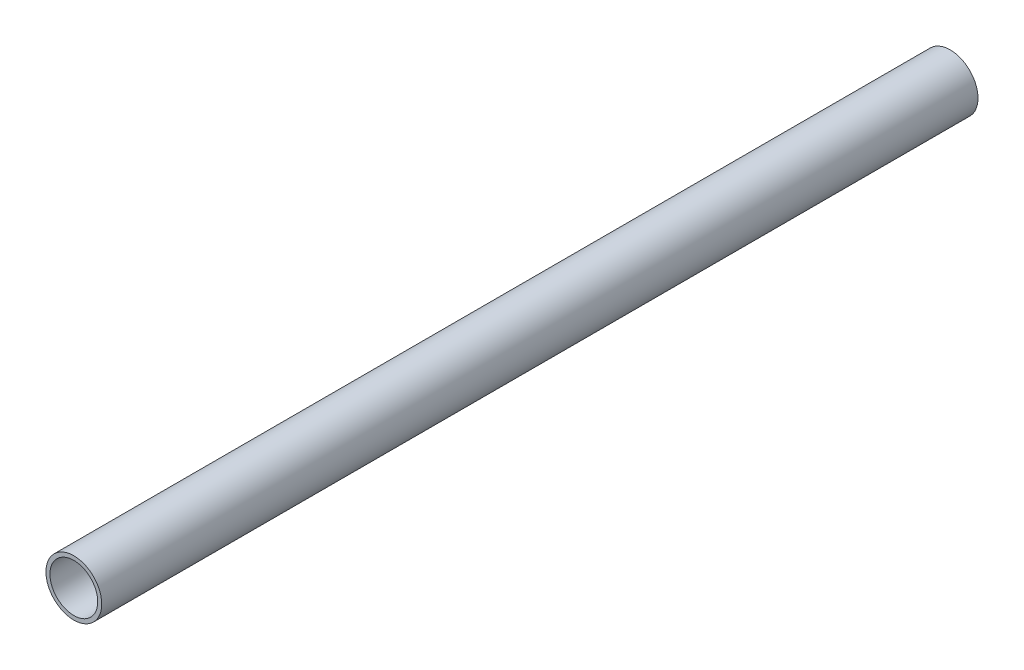
ISO-10303-21;
HEADER;
FILE_DESCRIPTION(('STEP AP214'),'2;1');
FILE_NAME('part.step','',(''),(''),'','','');
FILE_SCHEMA(('AUTOMOTIVE_DESIGN { 1 0 10303 214 1 1 1 1 }'));
ENDSEC;
DATA;
#1=APPLICATION_CONTEXT('core data for automotive mechanical design processes');
#2=APPLICATION_PROTOCOL_DEFINITION('international standard','automotive_design',2000,#1);
#3=PRODUCT_CONTEXT('',#1,'mechanical');
#4=PRODUCT('Part','Part','',(#3));
#5=PRODUCT_RELATED_PRODUCT_CATEGORY('part','',(#4));
#6=PRODUCT_DEFINITION_FORMATION('','',#4);
#7=PRODUCT_DEFINITION_CONTEXT('part definition',#1,'design');
#8=PRODUCT_DEFINITION('design','',#6,#7);
#9=PRODUCT_DEFINITION_SHAPE('','',#8);
#10=(LENGTH_UNIT() NAMED_UNIT(*) SI_UNIT(.MILLI.,.METRE.));
#11=(NAMED_UNIT(*) PLANE_ANGLE_UNIT() SI_UNIT($,.RADIAN.));
#12=(NAMED_UNIT(*) SI_UNIT($,.STERADIAN.) SOLID_ANGLE_UNIT());
#13=UNCERTAINTY_MEASURE_WITH_UNIT(LENGTH_MEASURE(1.E-05),#10,'distance_accuracy_value','');
#14=(GEOMETRIC_REPRESENTATION_CONTEXT(3) GLOBAL_UNCERTAINTY_ASSIGNED_CONTEXT((#13)) GLOBAL_UNIT_ASSIGNED_CONTEXT((#10,
#11,#12)) REPRESENTATION_CONTEXT('',''));
#15=CARTESIAN_POINT('',(0.,0.,0.));
#16=DIRECTION('',(0.,0.,1.));
#17=DIRECTION('',(1.,0.,0.));
#18=AXIS2_PLACEMENT_3D('',#15,#16,#17);
#19=CARTESIAN_POINT('',(0.,0.,220.));
#20=DIRECTION('',(0.,0.,1.));
#21=DIRECTION('',(1.,0.,0.));
#22=AXIS2_PLACEMENT_3D('',#19,#20,#21);
#23=PLANE('',#22);
#24=CARTESIAN_POINT('',(0.,0.,220.));
#25=DIRECTION('',(0.,0.,1.));
#26=DIRECTION('',(1.,0.,0.));
#27=AXIS2_PLACEMENT_3D('',#24,#25,#26);
#28=CIRCLE('',#27,7.);
#29=CARTESIAN_POINT('',(7.,0.,220.));
#30=VERTEX_POINT('',#29);
#31=EDGE_CURVE('E10',#30,#30,#28,.T.);
#32=ORIENTED_EDGE('',*,*,#31,.T.);
#33=EDGE_LOOP('',(#32));
#34=FACE_BOUND('',#33,.T.);
#35=CARTESIAN_POINT('',(0.,0.,220.));
#36=DIRECTION('',(0.,0.,1.));
#37=DIRECTION('',(1.,0.,0.));
#38=AXIS2_PLACEMENT_3D('',#35,#36,#37);
#39=CIRCLE('',#38,6.);
#40=CARTESIAN_POINT('',(6.,0.,220.));
#41=VERTEX_POINT('',#40);
#42=EDGE_CURVE('E45',#41,#41,#39,.T.);
#43=ORIENTED_EDGE('',*,*,#42,.F.);
#44=EDGE_LOOP('',(#43));
#45=FACE_BOUND('',#44,.T.);
#46=ADVANCED_FACE('F34',(#34,#45),#23,.T.);
#47=CARTESIAN_POINT('',(0.,0.,0.));
#48=DIRECTION('',(0.,0.,1.));
#49=DIRECTION('',(1.,0.,0.));
#50=AXIS2_PLACEMENT_3D('',#47,#48,#49);
#51=PLANE('',#50);
#52=CARTESIAN_POINT('',(0.,0.,0.));
#53=DIRECTION('',(0.,0.,1.));
#54=DIRECTION('',(1.,0.,0.));
#55=AXIS2_PLACEMENT_3D('',#52,#53,#54);
#56=CIRCLE('',#55,7.);
#57=CARTESIAN_POINT('',(7.,0.,0.));
#58=VERTEX_POINT('',#57);
#59=EDGE_CURVE('E38',#58,#58,#56,.T.);
#60=ORIENTED_EDGE('',*,*,#59,.F.);
#61=EDGE_LOOP('',(#60));
#62=FACE_BOUND('',#61,.T.);
#63=CARTESIAN_POINT('',(0.,0.,0.));
#64=DIRECTION('',(0.,0.,1.));
#65=DIRECTION('',(1.,0.,0.));
#66=AXIS2_PLACEMENT_3D('',#63,#64,#65);
#67=CIRCLE('',#66,6.);
#68=CARTESIAN_POINT('',(6.,0.,0.));
#69=VERTEX_POINT('',#68);
#70=EDGE_CURVE('E47',#69,#69,#67,.T.);
#71=ORIENTED_EDGE('',*,*,#70,.T.);
#72=EDGE_LOOP('',(#71));
#73=FACE_BOUND('',#72,.T.);
#74=ADVANCED_FACE('F57',(#62,#73),#51,.F.);
#75=CARTESIAN_POINT('',(0.,0.,220.));
#76=DIRECTION('',(0.,0.,-1.));
#77=DIRECTION('',(-1.,0.,0.));
#78=AXIS2_PLACEMENT_3D('',#75,#76,#77);
#79=CYLINDRICAL_SURFACE('',#78,7.);
#80=ORIENTED_EDGE('',*,*,#31,.F.);
#81=EDGE_LOOP('',(#80));
#82=FACE_BOUND('',#81,.T.);
#83=ORIENTED_EDGE('',*,*,#59,.T.);
#84=EDGE_LOOP('',(#83));
#85=FACE_BOUND('',#84,.T.);
#86=ADVANCED_FACE('F36',(#82,#85),#79,.T.);
#87=CARTESIAN_POINT('',(0.,0.,220.));
#88=DIRECTION('',(0.,0.,-1.));
#89=DIRECTION('',(-1.,0.,0.));
#90=AXIS2_PLACEMENT_3D('',#87,#88,#89);
#91=CYLINDRICAL_SURFACE('',#90,6.);
#92=ORIENTED_EDGE('',*,*,#42,.T.);
#93=EDGE_LOOP('',(#92));
#94=FACE_BOUND('',#93,.T.);
#95=ORIENTED_EDGE('',*,*,#70,.F.);
#96=EDGE_LOOP('',(#95));
#97=FACE_BOUND('',#96,.T.);
#98=ADVANCED_FACE('F53',(#94,#97),#91,.F.);
#99=CLOSED_SHELL('',(#46,#74,#86,#98));
#100=MANIFOLD_SOLID_BREP('B2',#99);
#101=ADVANCED_BREP_SHAPE_REPRESENTATION('',(#18,#100),#14);
#102=SHAPE_DEFINITION_REPRESENTATION(#9,#101);
ENDSEC;
END-ISO-10303-21;
